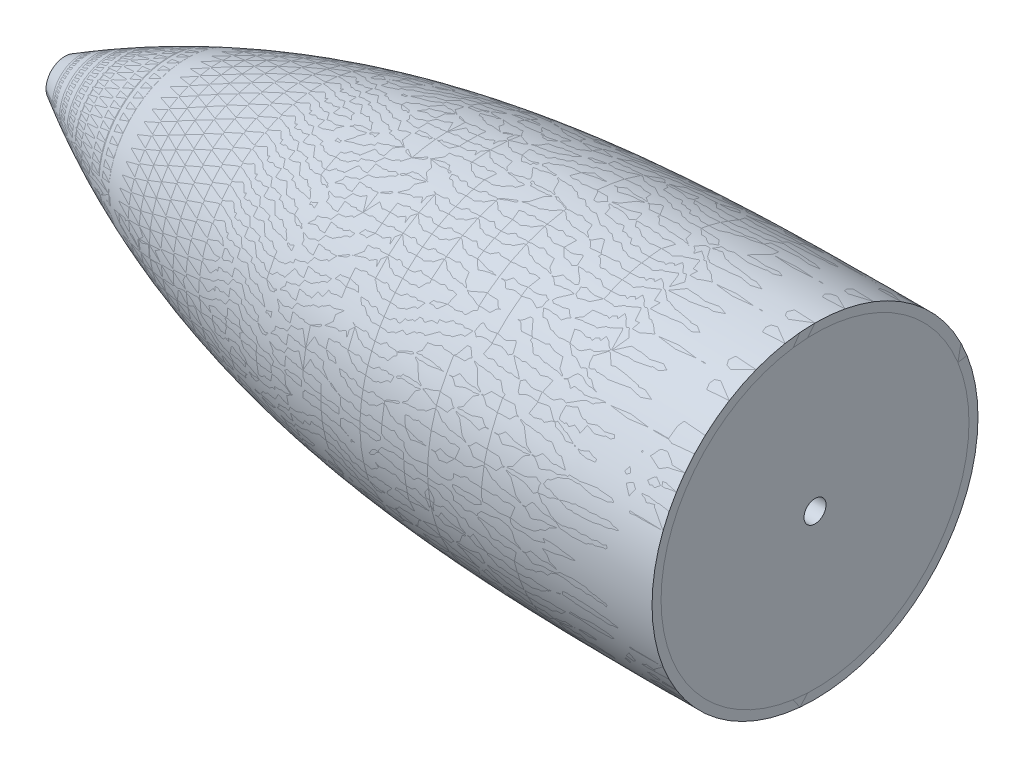
ISO-10303-21;
HEADER;
FILE_DESCRIPTION(('STEP AP214'),'2;1');
FILE_NAME('part.step','',(''),(''),'','','');
FILE_SCHEMA(('AUTOMOTIVE_DESIGN { 1 0 10303 214 1 1 1 1 }'));
ENDSEC;
DATA;
#1=APPLICATION_CONTEXT('core data for automotive mechanical design processes');
#2=APPLICATION_PROTOCOL_DEFINITION('international standard','automotive_design',2000,#1);
#3=PRODUCT_CONTEXT('',#1,'mechanical');
#4=PRODUCT('Part','Part','',(#3));
#5=PRODUCT_RELATED_PRODUCT_CATEGORY('part','',(#4));
#6=PRODUCT_DEFINITION_FORMATION('','',#4);
#7=PRODUCT_DEFINITION_CONTEXT('part definition',#1,'design');
#8=PRODUCT_DEFINITION('design','',#6,#7);
#9=PRODUCT_DEFINITION_SHAPE('','',#8);
#10=(LENGTH_UNIT() NAMED_UNIT(*) SI_UNIT(.MILLI.,.METRE.));
#11=(NAMED_UNIT(*) PLANE_ANGLE_UNIT() SI_UNIT($,.RADIAN.));
#12=(NAMED_UNIT(*) SI_UNIT($,.STERADIAN.) SOLID_ANGLE_UNIT());
#13=UNCERTAINTY_MEASURE_WITH_UNIT(LENGTH_MEASURE(1.E-05),#10,'distance_accuracy_value','');
#14=(GEOMETRIC_REPRESENTATION_CONTEXT(3) GLOBAL_UNCERTAINTY_ASSIGNED_CONTEXT((#13)) GLOBAL_UNIT_ASSIGNED_CONTEXT((#10,
#11,#12)) REPRESENTATION_CONTEXT('',''));
#15=CARTESIAN_POINT('',(0.,0.,0.));
#16=DIRECTION('',(0.,0.,1.));
#17=DIRECTION('',(1.,0.,0.));
#18=AXIS2_PLACEMENT_3D('',#15,#16,#17);
#19=CARTESIAN_POINT('',(1998.59980802861,500.036849404884,-10.4300161785152));
#20=CARTESIAN_POINT('',(2014.14259062486,500.036849404884,-19.4045646924462));
#21=CARTESIAN_POINT('',(2030.01224919325,500.036849404884,-27.558302677373));
#22=CARTESIAN_POINT('',(2062.40654859525,500.036849404884,-42.2210681594105));
#23=CARTESIAN_POINT('',(2078.93137499077,500.036849404884,-48.7296296963989));
#24=CARTESIAN_POINT('',(2104.19714689456,500.036849404884,-57.2908408254729));
#25=CARTESIAN_POINT('',(2112.69866377501,500.036849404884,-59.9447139867935));
#26=CARTESIAN_POINT('',(2125.56706385674,500.036849404884,-63.6339255855182));
#27=CARTESIAN_POINT('',(2132.03027736365,500.036849404884,-65.4056763559408));
#28=CARTESIAN_POINT('',(2138.53622029027,500.036849404884,-67.0701302902628));
#29=CARTESIAN_POINT('',(2142.88291162473,500.036849404884,-68.156172047267));
#30=CARTESIAN_POINT('',(2145.06182038872,500.036849404884,-68.6875957351419));
#31=CARTESIAN_POINT('',(2164.68617644722,500.036849404884,-73.3589276736872));
#32=CARTESIAN_POINT('',(2182.25360633561,500.036849404884,-76.7232642966897));
#33=CARTESIAN_POINT('',(2217.59489504651,500.036849404884,-82.1354899233301));
#34=CARTESIAN_POINT('',(2235.36873230754,500.036849404884,-84.1835164298222));
#35=CARTESIAN_POINT('',(2262.14953112241,500.036849404884,-86.4900132132574));
#36=CARTESIAN_POINT('',(2271.08385534817,500.036849404884,-87.1304462783594));
#37=CARTESIAN_POINT('',(2288.95484670745,500.036849404884,-88.1960069303877));
#38=CARTESIAN_POINT('',(2297.8933291923,500.036849404884,-88.6212942490631));
#39=CARTESIAN_POINT('',(2342.59769770862,500.036849404884,-90.3174395440905));
#40=CARTESIAN_POINT('',(2378.39952151114,500.036849404884,-90.2949225553577));
#41=CARTESIAN_POINT('',(2414.20089839684,500.036849404884,-90.2884897864431));
#42=B_SPLINE_CURVE_WITH_KNOTS('',3,(#19,#20,#21,#22,#23,#24,#25,#26,#27,#28,#29,#30,#31,#32,#33,
#34,#35,#36,#37,#38,#39,#40,#41),.UNSPECIFIED.,.F.,.F.,(4,2,2,2,1,2,2,2,2,2,2,4),(0.,
0.124999999999993,0.249999999999986,0.312499999999981,0.343749999999978,0.359374999999977,
0.374999999999976,0.49999999999998,0.624999999999985,0.687499999999988,0.74999999999999,1.),.UNSPECIFIED.);
#43=CARTESIAN_POINT('',(1968.59053717888,500.036849404884,0.));
#44=DIRECTION('',(-1.,0.,0.));
#45=AXIS1_PLACEMENT('',#43,#44);
#46=SURFACE_OF_REVOLUTION('',#42,#45);
#47=CARTESIAN_POINT('',(2414.20089839684,500.036849404884,0.));
#48=DIRECTION('',(-1.,0.,0.));
#49=DIRECTION('',(0.,0.,1.));
#50=AXIS2_PLACEMENT_3D('',#47,#48,#49);
#51=CIRCLE('',#50,90.2884897864431);
#52=CARTESIAN_POINT('',(2414.20089839684,500.036849404884,90.2884897864431));
#53=VERTEX_POINT('',#52);
#54=EDGE_CURVE('E71',#53,#53,#51,.T.);
#55=ORIENTED_EDGE('',*,*,#54,.T.);
#56=EDGE_LOOP('',(#55));
#57=FACE_BOUND('',#56,.T.);
#58=CARTESIAN_POINT('',(1998.59980802861,500.036849404884,0.));
#59=DIRECTION('',(-1.,0.,0.));
#60=DIRECTION('',(0.,0.,1.));
#61=AXIS2_PLACEMENT_3D('',#58,#59,#60);
#62=CIRCLE('',#61,10.4300161785152);
#63=CARTESIAN_POINT('',(1998.59980802861,500.036849404884,10.4300161785152));
#64=VERTEX_POINT('',#63);
#65=EDGE_CURVE('E12',#64,#64,#62,.T.);
#66=ORIENTED_EDGE('',*,*,#65,.F.);
#67=EDGE_LOOP('',(#66));
#68=FACE_BOUND('',#67,.T.);
#69=ADVANCED_FACE('F56',(#57,#68),#46,.F.);
#70=CARTESIAN_POINT('',(2001.1,500.036849404884,0.));
#71=DIRECTION('',(-1.,0.,0.));
#72=DIRECTION('',(0.,0.,1.));
#73=AXIS2_PLACEMENT_3D('',#70,#71,#72);
#74=CONICAL_SURFACE('',#73,6.10000000000022,1.04715321673594);
#75=ORIENTED_EDGE('',*,*,#65,.T.);
#76=EDGE_LOOP('',(#75));
#77=FACE_BOUND('',#76,.T.);
#78=CARTESIAN_POINT('',(2001.1,500.036849404884,0.));
#79=DIRECTION('',(-1.,0.,0.));
#80=DIRECTION('',(0.,0.,1.));
#81=AXIS2_PLACEMENT_3D('',#78,#79,#80);
#82=CIRCLE('',#81,6.10000000000022);
#83=CARTESIAN_POINT('',(2001.1,500.036849404884,6.10000000000022));
#84=VERTEX_POINT('',#83);
#85=EDGE_CURVE('E63',#84,#84,#82,.T.);
#86=ORIENTED_EDGE('',*,*,#85,.F.);
#87=EDGE_LOOP('',(#86));
#88=FACE_BOUND('',#87,.T.);
#89=ADVANCED_FACE('F90',(#77,#88),#74,.F.);
#90=CARTESIAN_POINT('',(2414.2,500.036849404884,-85.2884898671548));
#91=CARTESIAN_POINT('',(2276.5,500.036849404884,-85.3132317166755));
#92=CARTESIAN_POINT('',(2138.8,500.036849404884,-85.6092720827538));
#93=CARTESIAN_POINT('',(2001.1,500.036849404884,-6.10000000000022));
#94=B_SPLINE_CURVE_WITH_KNOTS('',3,(#90,#91,#92,#93),.UNSPECIFIED.,.F.,.F.,(4,4),
(0.0735402098982886,0.915776382718057),.UNSPECIFIED.);
#95=CARTESIAN_POINT('',(1968.59053717888,500.036849404884,0.));
#96=DIRECTION('',(-1.,0.,0.));
#97=AXIS1_PLACEMENT('',#95,#96);
#98=SURFACE_OF_REVOLUTION('',#94,#97);
#99=ORIENTED_EDGE('',*,*,#85,.T.);
#100=EDGE_LOOP('',(#99));
#101=FACE_BOUND('',#100,.T.);
#102=CARTESIAN_POINT('',(2414.2,500.036849404884,0.));
#103=DIRECTION('',(-1.,0.,0.));
#104=DIRECTION('',(0.,0.,1.));
#105=AXIS2_PLACEMENT_3D('',#102,#103,#104);
#106=CIRCLE('',#105,85.2884898671548);
#107=CARTESIAN_POINT('',(2414.2,500.036849404884,85.2884898671548));
#108=VERTEX_POINT('',#107);
#109=EDGE_CURVE('E67',#108,#108,#106,.T.);
#110=ORIENTED_EDGE('',*,*,#109,.F.);
#111=EDGE_LOOP('',(#110));
#112=FACE_BOUND('',#111,.T.);
#113=ADVANCED_FACE('F86',(#101,#112),#98,.F.);
#114=CARTESIAN_POINT('',(2414.20089839684,500.036849404884,0.));
#115=DIRECTION('',(1.,0.,0.));
#116=DIRECTION('',(0.,0.,-1.));
#117=AXIS2_PLACEMENT_3D('',#114,#115,#116);
#118=CONICAL_SURFACE('',#117,90.2884897864431,1.57061664742486);
#119=ORIENTED_EDGE('',*,*,#109,.T.);
#120=EDGE_LOOP('',(#119));
#121=FACE_BOUND('',#120,.T.);
#122=ORIENTED_EDGE('',*,*,#54,.F.);
#123=EDGE_LOOP('',(#122));
#124=FACE_BOUND('',#123,.T.);
#125=ADVANCED_FACE('F89',(#121,#124),#118,.F.);
#126=CLOSED_SHELL('',(#69,#89,#113,#125));
#127=MANIFOLD_SOLID_BREP('B2',#126);
#128=CARTESIAN_POINT('',(2414.20089839684,500.036849404884,90.2884897864431));
#129=CARTESIAN_POINT('',(2378.46714998193,500.036849404884,90.2949104039165));
#130=CARTESIAN_POINT('',(2342.73282495198,500.036849404884,90.3170558514028));
#131=CARTESIAN_POINT('',(2289.20672283842,500.036849404884,88.2944429629576));
#132=CARTESIAN_POINT('',(2271.37723527053,500.036849404884,87.2780847231159));
#133=CARTESIAN_POINT('',(2249.11379781785,500.036849404884,85.3688969308962));
#134=CARTESIAN_POINT('',(2244.66228072573,500.036849404884,84.9551415155004));
#135=CARTESIAN_POINT('',(2235.7617778574,500.036849404884,84.0585993375319));
#136=CARTESIAN_POINT('',(2231.31081152513,500.036849404884,83.5755687365466));
#137=CARTESIAN_POINT('',(2217.98047571047,500.036849404884,82.0174238746538));
#138=CARTESIAN_POINT('',(2209.12304828909,500.036849404884,80.8332584425348));
#139=CARTESIAN_POINT('',(2182.64954659327,500.036849404884,76.7932743915234));
#140=CARTESIAN_POINT('',(2165.13254697585,500.036849404884,73.4485166736477));
#141=CARTESIAN_POINT('',(2139.09149066048,500.036849404884,67.2743899359648));
#142=CARTESIAN_POINT('',(2130.45013957859,500.036849404884,65.0238754097207));
#143=CARTESIAN_POINT('',(2117.5505081475,500.036849404884,61.3401797803612));
#144=CARTESIAN_POINT('',(2113.26070466467,500.036849404884,60.0608834253486));
#145=CARTESIAN_POINT('',(2104.70378094178,500.036849404884,57.3971700411587));
#146=CARTESIAN_POINT('',(2100.4457582049,500.036849404884,56.0155895244661));
#147=CARTESIAN_POINT('',(2079.25906173691,500.036849404884,48.8560959536234));
#148=CARTESIAN_POINT('',(2062.6415410105,500.036849404884,42.3212171409476));
#149=CARTESIAN_POINT('',(2038.22502665911,500.036849404884,31.2787503137838));
#150=CARTESIAN_POINT('',(2030.17096795362,500.036849404884,27.3916786666226));
#151=CARTESIAN_POINT('',(2018.21711402558,500.036849404884,21.2515389772453));
#152=CARTESIAN_POINT('',(2014.25537252393,500.036849404884,19.1540653205562));
#153=CARTESIAN_POINT('',(2006.38802153955,500.036849404884,14.8641753139951));
#154=CARTESIAN_POINT('',(2002.48082786557,500.036849404884,12.670953449212));
#155=CARTESIAN_POINT('',(1998.59980802861,500.036849404884,10.4300161785152));
#156=B_SPLINE_CURVE_WITH_KNOTS('',3,(#128,#129,#130,#131,#132,#133,#134,#135,#136,#137,#138,
#139,#140,#141,#142,#143,#144,#145,#146,#147,#148,#149,#150,#151,#152,#153,#154,#155),
.UNSPECIFIED.,.F.,.F.,(4,2,2,2,2,2,2,2,2,2,2,2,2,4),(0.,0.249999999999999,0.374999999999998,
0.40625,0.437500000000001,0.500000000000004,0.62500000000001,0.687500000000011,
0.718750000000012,0.750000000000012,0.875000000000006,0.937500000000004,0.968750000000002,1.),.UNSPECIFIED.);
#157=CARTESIAN_POINT('',(1968.59053717888,500.036849404884,0.));
#158=DIRECTION('',(-1.,0.,0.));
#159=AXIS1_PLACEMENT('',#157,#158);
#160=SURFACE_OF_REVOLUTION('',#156,#159);
#161=CARTESIAN_POINT('',(1998.59980802861,500.036849404884,0.));
#162=DIRECTION('',(-1.,0.,0.));
#163=DIRECTION('',(0.,0.,1.));
#164=AXIS2_PLACEMENT_3D('',#161,#162,#163);
#165=CIRCLE('',#164,10.4300161785152);
#166=CARTESIAN_POINT('',(1998.59980802861,500.036849404884,10.4300161785152));
#167=VERTEX_POINT('',#166);
#168=EDGE_CURVE('E55',#167,#167,#165,.T.);
#169=ORIENTED_EDGE('',*,*,#168,.F.);
#170=EDGE_LOOP('',(#169));
#171=FACE_BOUND('',#170,.T.);
#172=CARTESIAN_POINT('',(2414.20089839684,500.036849404884,0.));
#173=DIRECTION('',(-1.,0.,0.));
#174=DIRECTION('',(0.,0.,1.));
#175=AXIS2_PLACEMENT_3D('',#172,#173,#174);
#176=CIRCLE('',#175,90.2884897864431);
#177=CARTESIAN_POINT('',(2414.20089839684,500.036849404884,90.2884897864431));
#178=VERTEX_POINT('',#177);
#179=EDGE_CURVE('E163',#178,#178,#176,.T.);
#180=ORIENTED_EDGE('',*,*,#179,.T.);
#181=EDGE_LOOP('',(#180));
#182=FACE_BOUND('',#181,.T.);
#183=ADVANCED_FACE('F148',(#171,#182),#160,.T.);
#184=CARTESIAN_POINT('',(1998.59980802861,500.036849404884,0.));
#185=DIRECTION('',(-1.,0.,0.));
#186=DIRECTION('',(0.,0.,1.));
#187=AXIS2_PLACEMENT_3D('',#184,#185,#186);
#188=CONICAL_SURFACE('',#187,10.4300161785152,1.04715321673594);
#189=CARTESIAN_POINT('',(2001.1,500.036849404884,0.));
#190=DIRECTION('',(-1.,0.,0.));
#191=DIRECTION('',(0.,0.,1.));
#192=AXIS2_PLACEMENT_3D('',#189,#190,#191);
#193=CIRCLE('',#192,6.10000000000022);
#194=CARTESIAN_POINT('',(2001.1,500.036849404884,6.10000000000022));
#195=VERTEX_POINT('',#194);
#196=EDGE_CURVE('E155',#195,#195,#193,.T.);
#197=ORIENTED_EDGE('',*,*,#196,.F.);
#198=EDGE_LOOP('',(#197));
#199=FACE_BOUND('',#198,.T.);
#200=ORIENTED_EDGE('',*,*,#168,.T.);
#201=EDGE_LOOP('',(#200));
#202=FACE_BOUND('',#201,.T.);
#203=ADVANCED_FACE('F182',(#199,#202),#188,.F.);
#204=CARTESIAN_POINT('',(2001.1,500.036849404884,6.10000000000022));
#205=CARTESIAN_POINT('',(2138.8,500.036849404884,85.6092720827538));
#206=CARTESIAN_POINT('',(2276.5,500.036849404884,85.3132317166755));
#207=CARTESIAN_POINT('',(2414.2,500.036849404884,85.2884898671548));
#208=B_SPLINE_CURVE_WITH_KNOTS('',3,(#204,#205,#206,#207),.UNSPECIFIED.,.F.,.F.,(4,4),
(0.0735402098982886,0.915776382718057),.UNSPECIFIED.);
#209=CARTESIAN_POINT('',(1968.59053717888,500.036849404884,0.));
#210=DIRECTION('',(-1.,0.,0.));
#211=AXIS1_PLACEMENT('',#209,#210);
#212=SURFACE_OF_REVOLUTION('',#208,#211);
#213=CARTESIAN_POINT('',(2414.2,500.036849404884,0.));
#214=DIRECTION('',(-1.,0.,0.));
#215=DIRECTION('',(0.,0.,1.));
#216=AXIS2_PLACEMENT_3D('',#213,#214,#215);
#217=CIRCLE('',#216,85.2884898671548);
#218=CARTESIAN_POINT('',(2414.2,500.036849404884,85.2884898671548));
#219=VERTEX_POINT('',#218);
#220=EDGE_CURVE('E159',#219,#219,#217,.T.);
#221=ORIENTED_EDGE('',*,*,#220,.F.);
#222=EDGE_LOOP('',(#221));
#223=FACE_BOUND('',#222,.T.);
#224=ORIENTED_EDGE('',*,*,#196,.T.);
#225=EDGE_LOOP('',(#224));
#226=FACE_BOUND('',#225,.T.);
#227=ADVANCED_FACE('F178',(#223,#226),#212,.T.);
#228=CARTESIAN_POINT('',(2414.2,500.036849404884,0.));
#229=DIRECTION('',(1.,0.,0.));
#230=DIRECTION('',(0.,0.,-1.));
#231=AXIS2_PLACEMENT_3D('',#228,#229,#230);
#232=CONICAL_SURFACE('',#231,85.2884898671548,1.57061664742486);
#233=ORIENTED_EDGE('',*,*,#179,.F.);
#234=EDGE_LOOP('',(#233));
#235=FACE_BOUND('',#234,.T.);
#236=ORIENTED_EDGE('',*,*,#220,.T.);
#237=EDGE_LOOP('',(#236));
#238=FACE_BOUND('',#237,.T.);
#239=ADVANCED_FACE('F181',(#235,#238),#232,.F.);
#240=CLOSED_SHELL('',(#183,#203,#227,#239));
#241=MANIFOLD_SOLID_BREP('B7',#240);
#242=CARTESIAN_POINT('',(2414.2,585.325339272039,0.));
#243=CARTESIAN_POINT('',(2276.5,585.350081121559,0.));
#244=CARTESIAN_POINT('',(2138.8,585.646121487638,0.));
#245=CARTESIAN_POINT('',(2001.1,506.136849404884,0.));
#246=B_SPLINE_CURVE_WITH_KNOTS('',3,(#242,#243,#244,#245),.UNSPECIFIED.,.F.,.F.,(4,4),
(0.0735402098982886,0.915776382718057),.UNSPECIFIED.);
#247=CARTESIAN_POINT('',(1940.01279946323,500.036849404884,0.));
#248=DIRECTION('',(-1.,0.,0.));
#249=AXIS1_PLACEMENT('',#247,#248);
#250=SURFACE_OF_REVOLUTION('',#246,#249);
#251=CARTESIAN_POINT('',(2001.1,500.036849404884,0.));
#252=DIRECTION('',(-1.,0.,0.));
#253=DIRECTION('',(0.,0.,1.));
#254=AXIS2_PLACEMENT_3D('',#251,#252,#253);
#255=CIRCLE('',#254,6.09999999999999);
#256=CARTESIAN_POINT('',(2001.1,500.036849404884,6.09999999999999));
#257=VERTEX_POINT('',#256);
#258=EDGE_CURVE('E280',#257,#257,#255,.T.);
#259=ORIENTED_EDGE('',*,*,#258,.F.);
#260=EDGE_LOOP('',(#259));
#261=FACE_BOUND('',#260,.T.);
#262=CARTESIAN_POINT('',(2414.2,500.036849404884,0.));
#263=DIRECTION('',(-1.,0.,0.));
#264=DIRECTION('',(0.,0.,1.));
#265=AXIS2_PLACEMENT_3D('',#262,#263,#264);
#266=CIRCLE('',#265,85.2884898671533);
#267=CARTESIAN_POINT('',(2414.2,500.036849404884,85.2884898671533));
#268=VERTEX_POINT('',#267);
#269=EDGE_CURVE('E328',#268,#268,#266,.T.);
#270=ORIENTED_EDGE('',*,*,#269,.T.);
#271=EDGE_LOOP('',(#270));
#272=FACE_BOUND('',#271,.T.);
#273=ADVANCED_FACE('F317',(#261,#272),#250,.T.);
#274=CARTESIAN_POINT('',(1940.01279946323,500.036849404884,0.));
#275=DIRECTION('',(-1.,0.,0.));
#276=DIRECTION('',(0.,0.,1.));
#277=AXIS2_PLACEMENT_3D('',#274,#275,#276);
#278=CYLINDRICAL_SURFACE('',#277,6.09999999999999);
#279=CARTESIAN_POINT('',(2414.2,500.036849404884,0.));
#280=DIRECTION('',(-1.,0.,0.));
#281=DIRECTION('',(0.,0.,1.));
#282=AXIS2_PLACEMENT_3D('',#279,#280,#281);
#283=CIRCLE('',#282,6.09999999999999);
#284=CARTESIAN_POINT('',(2414.2,500.036849404884,6.09999999999999));
#285=VERTEX_POINT('',#284);
#286=EDGE_CURVE('E324',#285,#285,#283,.T.);
#287=ORIENTED_EDGE('',*,*,#286,.F.);
#288=EDGE_LOOP('',(#287));
#289=FACE_BOUND('',#288,.T.);
#290=ORIENTED_EDGE('',*,*,#258,.T.);
#291=EDGE_LOOP('',(#290));
#292=FACE_BOUND('',#291,.T.);
#293=ADVANCED_FACE('F344',(#289,#292),#278,.F.);
#294=CARTESIAN_POINT('',(2414.2,585.325339272037,0.));
#295=DIRECTION('',(-1.,0.,0.));
#296=DIRECTION('',(0.,0.,1.));
#297=AXIS2_PLACEMENT_3D('',#294,#295,#296);
#298=PLANE('',#297);
#299=ORIENTED_EDGE('',*,*,#269,.F.);
#300=EDGE_LOOP('',(#299));
#301=FACE_BOUND('',#300,.T.);
#302=ORIENTED_EDGE('',*,*,#286,.T.);
#303=EDGE_LOOP('',(#302));
#304=FACE_BOUND('',#303,.T.);
#305=ADVANCED_FACE('F342',(#301,#304),#298,.F.);
#306=CLOSED_SHELL('',(#273,#293,#305));
#307=MANIFOLD_SOLID_BREP('B234_NOT_SHOWN',#306);
#308=ADVANCED_BREP_SHAPE_REPRESENTATION('',(#18,#127,#241,#307),#14);
#309=SHAPE_DEFINITION_REPRESENTATION(#9,#308);
ENDSEC;
END-ISO-10303-21;
